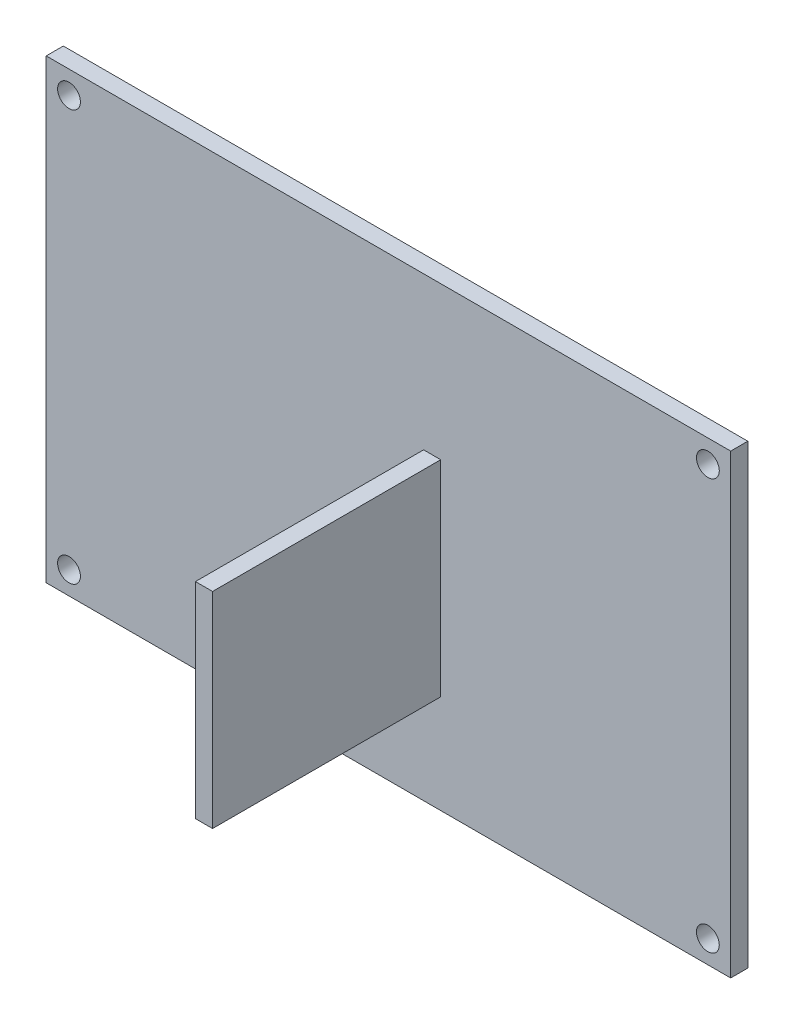
ISO-10303-21;
HEADER;
FILE_DESCRIPTION(('STEP AP214'),'2;1');
FILE_NAME('part.step','',(''),(''),'','','');
FILE_SCHEMA(('AUTOMOTIVE_DESIGN { 1 0 10303 214 1 1 1 1 }'));
ENDSEC;
DATA;
#1=APPLICATION_CONTEXT('core data for automotive mechanical design processes');
#2=APPLICATION_PROTOCOL_DEFINITION('international standard','automotive_design',2000,#1);
#3=PRODUCT_CONTEXT('',#1,'mechanical');
#4=PRODUCT('Part','Part','',(#3));
#5=PRODUCT_RELATED_PRODUCT_CATEGORY('part','',(#4));
#6=PRODUCT_DEFINITION_FORMATION('','',#4);
#7=PRODUCT_DEFINITION_CONTEXT('part definition',#1,'design');
#8=PRODUCT_DEFINITION('design','',#6,#7);
#9=PRODUCT_DEFINITION_SHAPE('','',#8);
#10=(LENGTH_UNIT() NAMED_UNIT(*) SI_UNIT(.MILLI.,.METRE.));
#11=(NAMED_UNIT(*) PLANE_ANGLE_UNIT() SI_UNIT($,.RADIAN.));
#12=(NAMED_UNIT(*) SI_UNIT($,.STERADIAN.) SOLID_ANGLE_UNIT());
#13=UNCERTAINTY_MEASURE_WITH_UNIT(LENGTH_MEASURE(1.E-05),#10,'distance_accuracy_value','');
#14=(GEOMETRIC_REPRESENTATION_CONTEXT(3) GLOBAL_UNCERTAINTY_ASSIGNED_CONTEXT((#13)) GLOBAL_UNIT_ASSIGNED_CONTEXT((#10,
#11,#12)) REPRESENTATION_CONTEXT('',''));
#15=CARTESIAN_POINT('',(0.,0.,0.));
#16=DIRECTION('',(0.,0.,1.));
#17=DIRECTION('',(1.,0.,0.));
#18=AXIS2_PLACEMENT_3D('',#15,#16,#17);
#19=CARTESIAN_POINT('',(0.,0.,1.5));
#20=DIRECTION('',(0.,0.,1.));
#21=DIRECTION('',(1.,0.,0.));
#22=AXIS2_PLACEMENT_3D('',#19,#20,#21);
#23=PLANE('',#22);
#24=DIRECTION('',(0.,1.,0.));
#25=VECTOR('',#24,1.);
#26=CARTESIAN_POINT('',(30.,20.,1.5));
#27=LINE('',#26,#25);
#28=CARTESIAN_POINT('',(30.,-20.,1.5));
#29=VERTEX_POINT('',#28);
#30=CARTESIAN_POINT('',(30.,20.,1.5));
#31=VERTEX_POINT('',#30);
#32=EDGE_CURVE('E161',#29,#31,#27,.T.);
#33=ORIENTED_EDGE('',*,*,#32,.T.);
#34=DIRECTION('',(-1.,0.,0.));
#35=VECTOR('',#34,1.);
#36=CARTESIAN_POINT('',(-30.,20.,1.5));
#37=LINE('',#36,#35);
#38=CARTESIAN_POINT('',(-30.,20.,1.5));
#39=VERTEX_POINT('',#38);
#40=EDGE_CURVE('E85',#31,#39,#37,.T.);
#41=ORIENTED_EDGE('',*,*,#40,.T.);
#42=DIRECTION('',(0.,-1.,0.));
#43=VECTOR('',#42,1.);
#44=CARTESIAN_POINT('',(-30.,20.,1.5));
#45=LINE('',#44,#43);
#46=CARTESIAN_POINT('',(-30.,-20.,1.5));
#47=VERTEX_POINT('',#46);
#48=EDGE_CURVE('E164',#39,#47,#45,.T.);
#49=ORIENTED_EDGE('',*,*,#48,.T.);
#50=DIRECTION('',(1.,0.,0.));
#51=VECTOR('',#50,1.);
#52=CARTESIAN_POINT('',(-30.,-20.,1.5));
#53=LINE('',#52,#51);
#54=EDGE_CURVE('E57',#47,#29,#53,.T.);
#55=ORIENTED_EDGE('',*,*,#54,.T.);
#56=EDGE_LOOP('',(#33,#41,#49,#55));
#57=FACE_BOUND('',#56,.T.);
#58=CARTESIAN_POINT('',(-28.,18.,1.5));
#59=DIRECTION('',(0.,0.,1.));
#60=DIRECTION('',(1.,0.,0.));
#61=AXIS2_PLACEMENT_3D('',#58,#59,#60);
#62=CIRCLE('',#61,1.);
#63=CARTESIAN_POINT('',(-27.,18.,1.5));
#64=VERTEX_POINT('',#63);
#65=EDGE_CURVE('E152',#64,#64,#62,.T.);
#66=ORIENTED_EDGE('',*,*,#65,.F.);
#67=EDGE_LOOP('',(#66));
#68=FACE_BOUND('',#67,.T.);
#69=CARTESIAN_POINT('',(28.,18.,1.5));
#70=DIRECTION('',(0.,0.,1.));
#71=DIRECTION('',(1.,0.,0.));
#72=AXIS2_PLACEMENT_3D('',#69,#70,#71);
#73=CIRCLE('',#72,1.);
#74=CARTESIAN_POINT('',(29.,18.,1.5));
#75=VERTEX_POINT('',#74);
#76=EDGE_CURVE('E146',#75,#75,#73,.T.);
#77=ORIENTED_EDGE('',*,*,#76,.F.);
#78=EDGE_LOOP('',(#77));
#79=FACE_BOUND('',#78,.T.);
#80=CARTESIAN_POINT('',(28.,-18.,1.5));
#81=DIRECTION('',(0.,0.,1.));
#82=DIRECTION('',(1.,0.,0.));
#83=AXIS2_PLACEMENT_3D('',#80,#81,#82);
#84=CIRCLE('',#83,1.);
#85=CARTESIAN_POINT('',(29.,-18.,1.5));
#86=VERTEX_POINT('',#85);
#87=EDGE_CURVE('E141',#86,#86,#84,.T.);
#88=ORIENTED_EDGE('',*,*,#87,.F.);
#89=EDGE_LOOP('',(#88));
#90=FACE_BOUND('',#89,.T.);
#91=CARTESIAN_POINT('',(-28.,-18.,1.5));
#92=DIRECTION('',(0.,0.,1.));
#93=DIRECTION('',(1.,0.,0.));
#94=AXIS2_PLACEMENT_3D('',#91,#92,#93);
#95=CIRCLE('',#94,1.);
#96=CARTESIAN_POINT('',(-27.,-18.,1.5));
#97=VERTEX_POINT('',#96);
#98=EDGE_CURVE('E132',#97,#97,#95,.T.);
#99=ORIENTED_EDGE('',*,*,#98,.F.);
#100=EDGE_LOOP('',(#99));
#101=FACE_BOUND('',#100,.T.);
#102=DIRECTION('',(-1.,0.,0.));
#103=VECTOR('',#102,1.);
#104=CARTESIAN_POINT('',(3.08316904857909,6.63561144076813,1.5));
#105=LINE('',#104,#103);
#106=CARTESIAN_POINT('',(4.58316904857909,6.63561144076813,1.5));
#107=VERTEX_POINT('',#106);
#108=CARTESIAN_POINT('',(3.08316904857909,6.63561144076813,1.5));
#109=VERTEX_POINT('',#108);
#110=EDGE_CURVE('E329',#107,#109,#105,.T.);
#111=ORIENTED_EDGE('',*,*,#110,.F.);
#112=DIRECTION('',(0.,1.,0.));
#113=VECTOR('',#112,1.);
#114=CARTESIAN_POINT('',(4.58316904857909,6.63561144076813,1.5));
#115=LINE('',#114,#113);
#116=CARTESIAN_POINT('',(4.5831690485791,-11.3643885592319,1.5));
#117=VERTEX_POINT('',#116);
#118=EDGE_CURVE('E130',#117,#107,#115,.T.);
#119=ORIENTED_EDGE('',*,*,#118,.F.);
#120=DIRECTION('',(1.,0.,0.));
#121=VECTOR('',#120,1.);
#122=CARTESIAN_POINT('',(3.0831690485791,-11.3643885592319,1.5));
#123=LINE('',#122,#121);
#124=CARTESIAN_POINT('',(3.0831690485791,-11.3643885592319,1.5));
#125=VERTEX_POINT('',#124);
#126=EDGE_CURVE('E126',#125,#117,#123,.T.);
#127=ORIENTED_EDGE('',*,*,#126,.F.);
#128=DIRECTION('',(0.,-1.,0.));
#129=VECTOR('',#128,1.);
#130=CARTESIAN_POINT('',(3.08316904857909,6.63561144076813,1.5));
#131=LINE('',#130,#129);
#132=EDGE_CURVE('E326',#109,#125,#131,.T.);
#133=ORIENTED_EDGE('',*,*,#132,.F.);
#134=EDGE_LOOP('',(#111,#119,#127,#133));
#135=FACE_BOUND('',#134,.T.);
#136=ADVANCED_FACE('F33',(#57,#68,#79,#90,#101,#135),#23,.T.);
#137=CARTESIAN_POINT('',(30.,20.,1.5));
#138=DIRECTION('',(-1.,0.,0.));
#139=DIRECTION('',(0.,-1.,0.));
#140=AXIS2_PLACEMENT_3D('',#137,#138,#139);
#141=PLANE('',#140);
#142=DIRECTION('',(0.,1.,0.));
#143=VECTOR('',#142,1.);
#144=CARTESIAN_POINT('',(30.,20.,0.));
#145=LINE('',#144,#143);
#146=CARTESIAN_POINT('',(30.,-20.,0.));
#147=VERTEX_POINT('',#146);
#148=CARTESIAN_POINT('',(30.,20.,0.));
#149=VERTEX_POINT('',#148);
#150=EDGE_CURVE('E158',#147,#149,#145,.T.);
#151=ORIENTED_EDGE('',*,*,#150,.T.);
#152=DIRECTION('',(0.,0.,-1.));
#153=VECTOR('',#152,1.);
#154=CARTESIAN_POINT('',(30.,20.,1.5));
#155=LINE('',#154,#153);
#156=EDGE_CURVE('E11',#31,#149,#155,.T.);
#157=ORIENTED_EDGE('',*,*,#156,.F.);
#158=ORIENTED_EDGE('',*,*,#32,.F.);
#159=DIRECTION('',(0.,0.,-1.));
#160=VECTOR('',#159,1.);
#161=CARTESIAN_POINT('',(30.,-20.,1.5));
#162=LINE('',#161,#160);
#163=EDGE_CURVE('E167',#29,#147,#162,.T.);
#164=ORIENTED_EDGE('',*,*,#163,.T.);
#165=EDGE_LOOP('',(#151,#157,#158,#164));
#166=FACE_BOUND('',#165,.T.);
#167=ADVANCED_FACE('F35',(#166),#141,.F.);
#168=CARTESIAN_POINT('',(-30.,20.,1.5));
#169=DIRECTION('',(0.,-1.,0.));
#170=DIRECTION('',(0.,0.,-1.));
#171=AXIS2_PLACEMENT_3D('',#168,#169,#170);
#172=PLANE('',#171);
#173=DIRECTION('',(-1.,0.,0.));
#174=VECTOR('',#173,1.);
#175=CARTESIAN_POINT('',(-30.,20.,0.));
#176=LINE('',#175,#174);
#177=CARTESIAN_POINT('',(-30.,20.,0.));
#178=VERTEX_POINT('',#177);
#179=EDGE_CURVE('E170',#149,#178,#176,.T.);
#180=ORIENTED_EDGE('',*,*,#179,.T.);
#181=DIRECTION('',(0.,0.,-1.));
#182=VECTOR('',#181,1.);
#183=CARTESIAN_POINT('',(-30.,20.,1.5));
#184=LINE('',#183,#182);
#185=EDGE_CURVE('E41',#39,#178,#184,.T.);
#186=ORIENTED_EDGE('',*,*,#185,.F.);
#187=ORIENTED_EDGE('',*,*,#40,.F.);
#188=ORIENTED_EDGE('',*,*,#156,.T.);
#189=EDGE_LOOP('',(#180,#186,#187,#188));
#190=FACE_BOUND('',#189,.T.);
#191=ADVANCED_FACE('F199',(#190),#172,.F.);
#192=CARTESIAN_POINT('',(-30.,20.,1.5));
#193=DIRECTION('',(1.,0.,0.));
#194=DIRECTION('',(0.,1.,0.));
#195=AXIS2_PLACEMENT_3D('',#192,#193,#194);
#196=PLANE('',#195);
#197=DIRECTION('',(0.,-1.,0.));
#198=VECTOR('',#197,1.);
#199=CARTESIAN_POINT('',(-30.,20.,0.));
#200=LINE('',#199,#198);
#201=CARTESIAN_POINT('',(-30.,-20.,0.));
#202=VERTEX_POINT('',#201);
#203=EDGE_CURVE('E172',#178,#202,#200,.T.);
#204=ORIENTED_EDGE('',*,*,#203,.T.);
#205=DIRECTION('',(0.,0.,-1.));
#206=VECTOR('',#205,1.);
#207=CARTESIAN_POINT('',(-30.,-20.,1.5));
#208=LINE('',#207,#206);
#209=EDGE_CURVE('E176',#47,#202,#208,.T.);
#210=ORIENTED_EDGE('',*,*,#209,.F.);
#211=ORIENTED_EDGE('',*,*,#48,.F.);
#212=ORIENTED_EDGE('',*,*,#185,.T.);
#213=EDGE_LOOP('',(#204,#210,#211,#212));
#214=FACE_BOUND('',#213,.T.);
#215=ADVANCED_FACE('F181',(#214),#196,.F.);
#216=CARTESIAN_POINT('',(-30.,-20.,1.5));
#217=DIRECTION('',(0.,1.,0.));
#218=DIRECTION('',(0.,0.,1.));
#219=AXIS2_PLACEMENT_3D('',#216,#217,#218);
#220=PLANE('',#219);
#221=DIRECTION('',(1.,0.,0.));
#222=VECTOR('',#221,1.);
#223=CARTESIAN_POINT('',(-30.,-20.,0.));
#224=LINE('',#223,#222);
#225=EDGE_CURVE('E78',#202,#147,#224,.T.);
#226=ORIENTED_EDGE('',*,*,#225,.T.);
#227=ORIENTED_EDGE('',*,*,#163,.F.);
#228=ORIENTED_EDGE('',*,*,#54,.F.);
#229=ORIENTED_EDGE('',*,*,#209,.T.);
#230=EDGE_LOOP('',(#226,#227,#228,#229));
#231=FACE_BOUND('',#230,.T.);
#232=ADVANCED_FACE('F189',(#231),#220,.F.);
#233=CARTESIAN_POINT('',(0.,0.,0.));
#234=DIRECTION('',(0.,0.,1.));
#235=DIRECTION('',(1.,0.,0.));
#236=AXIS2_PLACEMENT_3D('',#233,#234,#235);
#237=PLANE('',#236);
#238=CARTESIAN_POINT('',(-28.,-18.,0.));
#239=DIRECTION('',(0.,0.,1.));
#240=DIRECTION('',(1.,0.,0.));
#241=AXIS2_PLACEMENT_3D('',#238,#239,#240);
#242=CIRCLE('',#241,1.);
#243=CARTESIAN_POINT('',(-27.,-18.,0.));
#244=VERTEX_POINT('',#243);
#245=EDGE_CURVE('E135',#244,#244,#242,.T.);
#246=ORIENTED_EDGE('',*,*,#245,.T.);
#247=EDGE_LOOP('',(#246));
#248=FACE_BOUND('',#247,.T.);
#249=CARTESIAN_POINT('',(28.,-18.,0.));
#250=DIRECTION('',(0.,0.,1.));
#251=DIRECTION('',(1.,0.,0.));
#252=AXIS2_PLACEMENT_3D('',#249,#250,#251);
#253=CIRCLE('',#252,1.);
#254=CARTESIAN_POINT('',(29.,-18.,0.));
#255=VERTEX_POINT('',#254);
#256=EDGE_CURVE('E143',#255,#255,#253,.T.);
#257=ORIENTED_EDGE('',*,*,#256,.T.);
#258=EDGE_LOOP('',(#257));
#259=FACE_BOUND('',#258,.T.);
#260=CARTESIAN_POINT('',(28.,18.,0.));
#261=DIRECTION('',(0.,0.,1.));
#262=DIRECTION('',(1.,0.,0.));
#263=AXIS2_PLACEMENT_3D('',#260,#261,#262);
#264=CIRCLE('',#263,1.);
#265=CARTESIAN_POINT('',(29.,18.,0.));
#266=VERTEX_POINT('',#265);
#267=EDGE_CURVE('E149',#266,#266,#264,.T.);
#268=ORIENTED_EDGE('',*,*,#267,.T.);
#269=EDGE_LOOP('',(#268));
#270=FACE_BOUND('',#269,.T.);
#271=CARTESIAN_POINT('',(-28.,18.,0.));
#272=DIRECTION('',(0.,0.,1.));
#273=DIRECTION('',(1.,0.,0.));
#274=AXIS2_PLACEMENT_3D('',#271,#272,#273);
#275=CIRCLE('',#274,1.);
#276=CARTESIAN_POINT('',(-27.,18.,0.));
#277=VERTEX_POINT('',#276);
#278=EDGE_CURVE('E155',#277,#277,#275,.T.);
#279=ORIENTED_EDGE('',*,*,#278,.T.);
#280=EDGE_LOOP('',(#279));
#281=FACE_BOUND('',#280,.T.);
#282=ORIENTED_EDGE('',*,*,#150,.F.);
#283=ORIENTED_EDGE('',*,*,#225,.F.);
#284=ORIENTED_EDGE('',*,*,#203,.F.);
#285=ORIENTED_EDGE('',*,*,#179,.F.);
#286=EDGE_LOOP('',(#282,#283,#284,#285));
#287=FACE_BOUND('',#286,.T.);
#288=ADVANCED_FACE('F185',(#248,#259,#270,#281,#287),#237,.F.);
#289=CARTESIAN_POINT('',(-28.,18.,0.));
#290=DIRECTION('',(0.,0.,1.));
#291=DIRECTION('',(1.,0.,0.));
#292=AXIS2_PLACEMENT_3D('',#289,#290,#291);
#293=CYLINDRICAL_SURFACE('',#292,1.);
#294=ORIENTED_EDGE('',*,*,#278,.F.);
#295=EDGE_LOOP('',(#294));
#296=FACE_BOUND('',#295,.T.);
#297=ORIENTED_EDGE('',*,*,#65,.T.);
#298=EDGE_LOOP('',(#297));
#299=FACE_BOUND('',#298,.T.);
#300=ADVANCED_FACE('F196',(#296,#299),#293,.F.);
#301=CARTESIAN_POINT('',(28.,18.,0.));
#302=DIRECTION('',(0.,0.,1.));
#303=DIRECTION('',(1.,0.,0.));
#304=AXIS2_PLACEMENT_3D('',#301,#302,#303);
#305=CYLINDRICAL_SURFACE('',#304,1.);
#306=ORIENTED_EDGE('',*,*,#267,.F.);
#307=EDGE_LOOP('',(#306));
#308=FACE_BOUND('',#307,.T.);
#309=ORIENTED_EDGE('',*,*,#76,.T.);
#310=EDGE_LOOP('',(#309));
#311=FACE_BOUND('',#310,.T.);
#312=ADVANCED_FACE('F210',(#308,#311),#305,.F.);
#313=CARTESIAN_POINT('',(28.,-18.,0.));
#314=DIRECTION('',(0.,0.,1.));
#315=DIRECTION('',(1.,0.,0.));
#316=AXIS2_PLACEMENT_3D('',#313,#314,#315);
#317=CYLINDRICAL_SURFACE('',#316,1.);
#318=ORIENTED_EDGE('',*,*,#256,.F.);
#319=EDGE_LOOP('',(#318));
#320=FACE_BOUND('',#319,.T.);
#321=ORIENTED_EDGE('',*,*,#87,.T.);
#322=EDGE_LOOP('',(#321));
#323=FACE_BOUND('',#322,.T.);
#324=ADVANCED_FACE('F214',(#320,#323),#317,.F.);
#325=CARTESIAN_POINT('',(-28.,-18.,0.));
#326=DIRECTION('',(0.,0.,1.));
#327=DIRECTION('',(1.,0.,0.));
#328=AXIS2_PLACEMENT_3D('',#325,#326,#327);
#329=CYLINDRICAL_SURFACE('',#328,1.);
#330=ORIENTED_EDGE('',*,*,#245,.F.);
#331=EDGE_LOOP('',(#330));
#332=FACE_BOUND('',#331,.T.);
#333=ORIENTED_EDGE('',*,*,#98,.T.);
#334=EDGE_LOOP('',(#333));
#335=FACE_BOUND('',#334,.T.);
#336=ADVANCED_FACE('F218',(#332,#335),#329,.F.);
#337=CARTESIAN_POINT('',(4.58316904857909,6.63561144076813,21.5));
#338=DIRECTION('',(-1.,0.,0.));
#339=DIRECTION('',(0.,-1.,0.));
#340=AXIS2_PLACEMENT_3D('',#337,#338,#339);
#341=PLANE('',#340);
#342=ORIENTED_EDGE('',*,*,#118,.T.);
#343=DIRECTION('',(0.,0.,-1.));
#344=VECTOR('',#343,1.);
#345=CARTESIAN_POINT('',(4.58316904857909,6.63561144076813,21.5));
#346=LINE('',#345,#344);
#347=CARTESIAN_POINT('',(4.58316904857909,6.63561144076813,21.5));
#348=VERTEX_POINT('',#347);
#349=EDGE_CURVE('E111',#348,#107,#346,.T.);
#350=ORIENTED_EDGE('',*,*,#349,.F.);
#351=DIRECTION('',(0.,1.,0.));
#352=VECTOR('',#351,1.);
#353=CARTESIAN_POINT('',(4.58316904857909,6.63561144076813,21.5));
#354=LINE('',#353,#352);
#355=CARTESIAN_POINT('',(4.5831690485791,-11.3643885592319,21.5));
#356=VERTEX_POINT('',#355);
#357=EDGE_CURVE('E118',#356,#348,#354,.T.);
#358=ORIENTED_EDGE('',*,*,#357,.F.);
#359=DIRECTION('',(0.,0.,-1.));
#360=VECTOR('',#359,1.);
#361=CARTESIAN_POINT('',(4.5831690485791,-11.3643885592319,21.5));
#362=LINE('',#361,#360);
#363=EDGE_CURVE('E323',#356,#117,#362,.T.);
#364=ORIENTED_EDGE('',*,*,#363,.T.);
#365=EDGE_LOOP('',(#342,#350,#358,#364));
#366=FACE_BOUND('',#365,.T.);
#367=ADVANCED_FACE('F128',(#366),#341,.F.);
#368=CARTESIAN_POINT('',(3.08316904857909,6.63561144076813,21.5));
#369=DIRECTION('',(0.,-1.,0.));
#370=DIRECTION('',(0.,0.,-1.));
#371=AXIS2_PLACEMENT_3D('',#368,#369,#370);
#372=PLANE('',#371);
#373=ORIENTED_EDGE('',*,*,#110,.T.);
#374=DIRECTION('',(0.,0.,-1.));
#375=VECTOR('',#374,1.);
#376=CARTESIAN_POINT('',(3.08316904857909,6.63561144076813,21.5));
#377=LINE('',#376,#375);
#378=CARTESIAN_POINT('',(3.08316904857909,6.63561144076813,21.5));
#379=VERTEX_POINT('',#378);
#380=EDGE_CURVE('E114',#379,#109,#377,.T.);
#381=ORIENTED_EDGE('',*,*,#380,.F.);
#382=DIRECTION('',(-1.,0.,0.));
#383=VECTOR('',#382,1.);
#384=CARTESIAN_POINT('',(3.08316904857909,6.63561144076813,21.5));
#385=LINE('',#384,#383);
#386=EDGE_CURVE('E107',#348,#379,#385,.T.);
#387=ORIENTED_EDGE('',*,*,#386,.F.);
#388=ORIENTED_EDGE('',*,*,#349,.T.);
#389=EDGE_LOOP('',(#373,#381,#387,#388));
#390=FACE_BOUND('',#389,.T.);
#391=ADVANCED_FACE('F109',(#390),#372,.F.);
#392=CARTESIAN_POINT('',(3.08316904857909,6.63561144076813,21.5));
#393=DIRECTION('',(1.,0.,0.));
#394=DIRECTION('',(0.,1.,0.));
#395=AXIS2_PLACEMENT_3D('',#392,#393,#394);
#396=PLANE('',#395);
#397=ORIENTED_EDGE('',*,*,#132,.T.);
#398=DIRECTION('',(0.,0.,-1.));
#399=VECTOR('',#398,1.);
#400=CARTESIAN_POINT('',(3.0831690485791,-11.3643885592319,21.5));
#401=LINE('',#400,#399);
#402=CARTESIAN_POINT('',(3.0831690485791,-11.3643885592319,21.5));
#403=VERTEX_POINT('',#402);
#404=EDGE_CURVE('E48',#403,#125,#401,.T.);
#405=ORIENTED_EDGE('',*,*,#404,.F.);
#406=DIRECTION('',(0.,-1.,0.));
#407=VECTOR('',#406,1.);
#408=CARTESIAN_POINT('',(3.08316904857909,6.63561144076813,21.5));
#409=LINE('',#408,#407);
#410=EDGE_CURVE('E117',#379,#403,#409,.T.);
#411=ORIENTED_EDGE('',*,*,#410,.F.);
#412=ORIENTED_EDGE('',*,*,#380,.T.);
#413=EDGE_LOOP('',(#397,#405,#411,#412));
#414=FACE_BOUND('',#413,.T.);
#415=ADVANCED_FACE('F227',(#414),#396,.F.);
#416=CARTESIAN_POINT('',(3.0831690485791,-11.3643885592319,21.5));
#417=DIRECTION('',(0.,1.,0.));
#418=DIRECTION('',(0.,0.,1.));
#419=AXIS2_PLACEMENT_3D('',#416,#417,#418);
#420=PLANE('',#419);
#421=ORIENTED_EDGE('',*,*,#126,.T.);
#422=ORIENTED_EDGE('',*,*,#363,.F.);
#423=DIRECTION('',(1.,0.,0.));
#424=VECTOR('',#423,1.);
#425=CARTESIAN_POINT('',(3.0831690485791,-11.3643885592319,21.5));
#426=LINE('',#425,#424);
#427=EDGE_CURVE('E122',#403,#356,#426,.T.);
#428=ORIENTED_EDGE('',*,*,#427,.F.);
#429=ORIENTED_EDGE('',*,*,#404,.T.);
#430=EDGE_LOOP('',(#421,#422,#428,#429));
#431=FACE_BOUND('',#430,.T.);
#432=ADVANCED_FACE('F230',(#431),#420,.F.);
#433=CARTESIAN_POINT('',(0.,0.,21.5));
#434=DIRECTION('',(0.,0.,1.));
#435=DIRECTION('',(1.,0.,0.));
#436=AXIS2_PLACEMENT_3D('',#433,#434,#435);
#437=PLANE('',#436);
#438=ORIENTED_EDGE('',*,*,#357,.T.);
#439=ORIENTED_EDGE('',*,*,#386,.T.);
#440=ORIENTED_EDGE('',*,*,#410,.T.);
#441=ORIENTED_EDGE('',*,*,#427,.T.);
#442=EDGE_LOOP('',(#438,#439,#440,#441));
#443=FACE_BOUND('',#442,.T.);
#444=ADVANCED_FACE('F121',(#443),#437,.T.);
#445=CLOSED_SHELL('',(#136,#167,#191,#215,#232,#288,#300,#312,#324,#336,#367,#391,#415,#432,#444));
#446=MANIFOLD_SOLID_BREP('B2',#445);
#447=ADVANCED_BREP_SHAPE_REPRESENTATION('',(#18,#446),#14);
#448=SHAPE_DEFINITION_REPRESENTATION(#9,#447);
ENDSEC;
END-ISO-10303-21;
